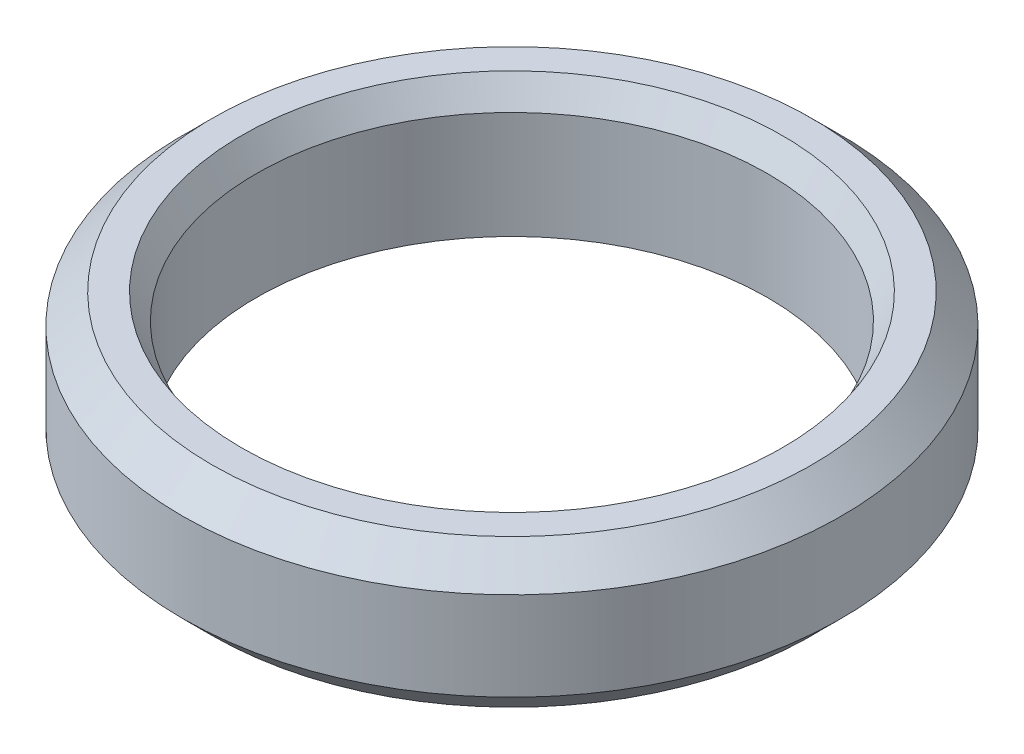
ISO-10303-21;
HEADER;
FILE_DESCRIPTION(('STEP AP214'),'2;1');
FILE_NAME('part.step','',(''),(''),'','','');
FILE_SCHEMA(('AUTOMOTIVE_DESIGN { 1 0 10303 214 1 1 1 1 }'));
ENDSEC;
DATA;
#1=APPLICATION_CONTEXT('core data for automotive mechanical design processes');
#2=APPLICATION_PROTOCOL_DEFINITION('international standard','automotive_design',2000,#1);
#3=PRODUCT_CONTEXT('',#1,'mechanical');
#4=PRODUCT('Part','Part','',(#3));
#5=PRODUCT_RELATED_PRODUCT_CATEGORY('part','',(#4));
#6=PRODUCT_DEFINITION_FORMATION('','',#4);
#7=PRODUCT_DEFINITION_CONTEXT('part definition',#1,'design');
#8=PRODUCT_DEFINITION('design','',#6,#7);
#9=PRODUCT_DEFINITION_SHAPE('','',#8);
#10=(LENGTH_UNIT() NAMED_UNIT(*) SI_UNIT(.MILLI.,.METRE.));
#11=(NAMED_UNIT(*) PLANE_ANGLE_UNIT() SI_UNIT($,.RADIAN.));
#12=(NAMED_UNIT(*) SI_UNIT($,.STERADIAN.) SOLID_ANGLE_UNIT());
#13=UNCERTAINTY_MEASURE_WITH_UNIT(LENGTH_MEASURE(1.E-05),#10,'distance_accuracy_value','');
#14=(GEOMETRIC_REPRESENTATION_CONTEXT(3) GLOBAL_UNCERTAINTY_ASSIGNED_CONTEXT((#13)) GLOBAL_UNIT_ASSIGNED_CONTEXT((#10,
#11,#12)) REPRESENTATION_CONTEXT('',''));
#15=CARTESIAN_POINT('',(0.,0.,0.));
#16=DIRECTION('',(0.,0.,1.));
#17=DIRECTION('',(1.,0.,0.));
#18=AXIS2_PLACEMENT_3D('',#15,#16,#17);
#19=CARTESIAN_POINT('',(0.,5.,0.));
#20=DIRECTION('',(0.,1.,0.));
#21=DIRECTION('',(0.,0.,1.));
#22=AXIS2_PLACEMENT_3D('',#19,#20,#21);
#23=PLANE('',#22);
#24=CARTESIAN_POINT('',(0.,5.,0.));
#25=DIRECTION('',(0.,1.,0.));
#26=DIRECTION('',(0.,0.,1.));
#27=AXIS2_PLACEMENT_3D('',#24,#25,#26);
#28=CIRCLE('',#27,9.14999999999999);
#29=CARTESIAN_POINT('',(0.,5.,9.14999999999999));
#30=VERTEX_POINT('',#29);
#31=EDGE_CURVE('E10',#30,#30,#28,.F.);
#32=ORIENTED_EDGE('',*,*,#31,.T.);
#33=EDGE_LOOP('',(#32));
#34=FACE_BOUND('',#33,.T.);
#35=CARTESIAN_POINT('',(0.,5.,0.));
#36=DIRECTION('',(0.,1.,0.));
#37=DIRECTION('',(0.,0.,1.));
#38=AXIS2_PLACEMENT_3D('',#35,#36,#37);
#39=CIRCLE('',#38,10.15);
#40=CARTESIAN_POINT('',(0.,5.,10.15));
#41=VERTEX_POINT('',#40);
#42=EDGE_CURVE('E63',#41,#41,#39,.T.);
#43=ORIENTED_EDGE('',*,*,#42,.T.);
#44=EDGE_LOOP('',(#43));
#45=FACE_BOUND('',#44,.T.);
#46=ADVANCED_FACE('F37',(#34,#45),#23,.T.);
#47=CARTESIAN_POINT('',(0.,0.,0.));
#48=DIRECTION('',(0.,1.,0.));
#49=DIRECTION('',(0.,0.,1.));
#50=AXIS2_PLACEMENT_3D('',#47,#48,#49);
#51=PLANE('',#50);
#52=CARTESIAN_POINT('',(0.,0.,0.));
#53=DIRECTION('',(0.,1.,0.));
#54=DIRECTION('',(0.,0.,1.));
#55=AXIS2_PLACEMENT_3D('',#52,#53,#54);
#56=CIRCLE('',#55,9.51602540378444);
#57=CARTESIAN_POINT('',(0.,0.,9.51602540378444));
#58=VERTEX_POINT('',#57);
#59=EDGE_CURVE('E58',#58,#58,#56,.T.);
#60=ORIENTED_EDGE('',*,*,#59,.T.);
#61=EDGE_LOOP('',(#60));
#62=FACE_BOUND('',#61,.T.);
#63=CARTESIAN_POINT('',(0.,0.,0.));
#64=DIRECTION('',(0.,1.,0.));
#65=DIRECTION('',(0.,0.,1.));
#66=AXIS2_PLACEMENT_3D('',#63,#64,#65);
#67=CIRCLE('',#66,10.15);
#68=CARTESIAN_POINT('',(0.,0.,10.15));
#69=VERTEX_POINT('',#68);
#70=EDGE_CURVE('E66',#69,#69,#67,.F.);
#71=ORIENTED_EDGE('',*,*,#70,.T.);
#72=EDGE_LOOP('',(#71));
#73=FACE_BOUND('',#72,.T.);
#74=ADVANCED_FACE('F90',(#62,#73),#51,.F.);
#75=CARTESIAN_POINT('',(0.,5.,0.));
#76=DIRECTION('',(0.,-1.,0.));
#77=DIRECTION('',(0.,0.,-1.));
#78=AXIS2_PLACEMENT_3D('',#75,#76,#77);
#79=CYLINDRICAL_SURFACE('',#78,11.15);
#80=CARTESIAN_POINT('',(0.,0.999999999999994,0.));
#81=DIRECTION('',(0.,1.,0.));
#82=DIRECTION('',(0.,0.,1.));
#83=AXIS2_PLACEMENT_3D('',#80,#81,#82);
#84=CIRCLE('',#83,11.15);
#85=CARTESIAN_POINT('',(0.,0.999999999999994,11.15));
#86=VERTEX_POINT('',#85);
#87=EDGE_CURVE('E70',#86,#86,#84,.T.);
#88=ORIENTED_EDGE('',*,*,#87,.T.);
#89=EDGE_LOOP('',(#88));
#90=FACE_BOUND('',#89,.T.);
#91=CARTESIAN_POINT('',(0.,4.,0.));
#92=DIRECTION('',(0.,1.,0.));
#93=DIRECTION('',(0.,0.,1.));
#94=AXIS2_PLACEMENT_3D('',#91,#92,#93);
#95=CIRCLE('',#94,11.15);
#96=CARTESIAN_POINT('',(0.,4.,11.15));
#97=VERTEX_POINT('',#96);
#98=EDGE_CURVE('E74',#97,#97,#95,.F.);
#99=ORIENTED_EDGE('',*,*,#98,.T.);
#100=EDGE_LOOP('',(#99));
#101=FACE_BOUND('',#100,.T.);
#102=ADVANCED_FACE('F79',(#90,#101),#79,.T.);
#103=CARTESIAN_POINT('',(0.,5.,0.));
#104=DIRECTION('',(0.,-1.,0.));
#105=DIRECTION('',(0.,0.,-1.));
#106=AXIS2_PLACEMENT_3D('',#103,#104,#105);
#107=CYLINDRICAL_SURFACE('',#106,8.65);
#108=CARTESIAN_POINT('',(0.,0.500000000000001,0.));
#109=DIRECTION('',(0.,1.,0.));
#110=DIRECTION('',(0.,0.,1.));
#111=AXIS2_PLACEMENT_3D('',#108,#109,#110);
#112=CIRCLE('',#111,8.65);
#113=CARTESIAN_POINT('',(0.,0.500000000000001,8.65));
#114=VERTEX_POINT('',#113);
#115=EDGE_CURVE('E46',#114,#114,#112,.F.);
#116=ORIENTED_EDGE('',*,*,#115,.T.);
#117=EDGE_LOOP('',(#116));
#118=FACE_BOUND('',#117,.T.);
#119=CARTESIAN_POINT('',(0.,4.13397459621557,0.));
#120=DIRECTION('',(0.,1.,0.));
#121=DIRECTION('',(0.,0.,1.));
#122=AXIS2_PLACEMENT_3D('',#119,#120,#121);
#123=CIRCLE('',#122,8.65);
#124=CARTESIAN_POINT('',(0.,4.13397459621557,8.65));
#125=VERTEX_POINT('',#124);
#126=EDGE_CURVE('E53',#125,#125,#123,.T.);
#127=ORIENTED_EDGE('',*,*,#126,.T.);
#128=EDGE_LOOP('',(#127));
#129=FACE_BOUND('',#128,.T.);
#130=ADVANCED_FACE('F98',(#118,#129),#107,.F.);
#131=CARTESIAN_POINT('',(0.,0.999999999999994,0.));
#132=DIRECTION('',(0.,1.,0.));
#133=DIRECTION('',(0.,0.,1.));
#134=AXIS2_PLACEMENT_3D('',#131,#132,#133);
#135=CONICAL_SURFACE('',#134,11.15,0.785398163397452);
#136=ORIENTED_EDGE('',*,*,#70,.F.);
#137=EDGE_LOOP('',(#136));
#138=FACE_BOUND('',#137,.T.);
#139=ORIENTED_EDGE('',*,*,#87,.F.);
#140=EDGE_LOOP('',(#139));
#141=FACE_BOUND('',#140,.T.);
#142=ADVANCED_FACE('F85',(#138,#141),#135,.T.);
#143=CARTESIAN_POINT('',(0.,5.,0.));
#144=DIRECTION('',(0.,-1.,0.));
#145=DIRECTION('',(0.,0.,-1.));
#146=AXIS2_PLACEMENT_3D('',#143,#144,#145);
#147=CONICAL_SURFACE('',#146,10.15,0.785398163397447);
#148=ORIENTED_EDGE('',*,*,#98,.F.);
#149=EDGE_LOOP('',(#148));
#150=FACE_BOUND('',#149,.T.);
#151=ORIENTED_EDGE('',*,*,#42,.F.);
#152=EDGE_LOOP('',(#151));
#153=FACE_BOUND('',#152,.T.);
#154=ADVANCED_FACE('F81',(#150,#153),#147,.T.);
#155=CARTESIAN_POINT('',(0.,0.,0.));
#156=DIRECTION('',(0.,-1.,0.));
#157=DIRECTION('',(0.,0.,-1.));
#158=AXIS2_PLACEMENT_3D('',#155,#156,#157);
#159=CONICAL_SURFACE('',#158,9.51602540378444,1.0471975511966);
#160=ORIENTED_EDGE('',*,*,#115,.F.);
#161=EDGE_LOOP('',(#160));
#162=FACE_BOUND('',#161,.T.);
#163=ORIENTED_EDGE('',*,*,#59,.F.);
#164=EDGE_LOOP('',(#163));
#165=FACE_BOUND('',#164,.T.);
#166=ADVANCED_FACE('F84',(#162,#165),#159,.F.);
#167=CARTESIAN_POINT('',(0.,4.13397459621557,0.));
#168=DIRECTION('',(0.,1.,0.));
#169=DIRECTION('',(0.,0.,1.));
#170=AXIS2_PLACEMENT_3D('',#167,#168,#169);
#171=CONICAL_SURFACE('',#170,8.65,0.523598775598298);
#172=ORIENTED_EDGE('',*,*,#31,.F.);
#173=EDGE_LOOP('',(#172));
#174=FACE_BOUND('',#173,.T.);
#175=ORIENTED_EDGE('',*,*,#126,.F.);
#176=EDGE_LOOP('',(#175));
#177=FACE_BOUND('',#176,.T.);
#178=ADVANCED_FACE('F40',(#174,#177),#171,.F.);
#179=CLOSED_SHELL('',(#46,#74,#102,#130,#142,#154,#166,#178));
#180=MANIFOLD_SOLID_BREP('B2',#179);
#181=ADVANCED_BREP_SHAPE_REPRESENTATION('',(#18,#180),#14);
#182=SHAPE_DEFINITION_REPRESENTATION(#9,#181);
ENDSEC;
END-ISO-10303-21;
